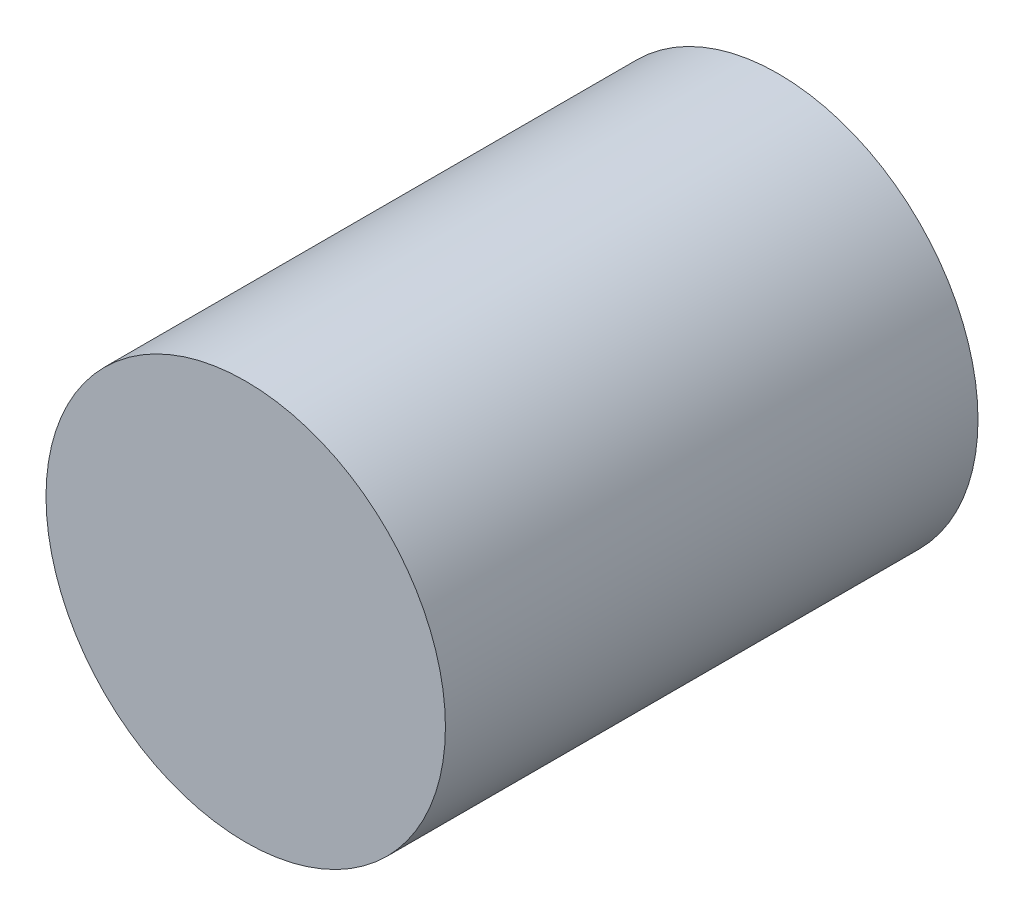
ISO-10303-21;
HEADER;
FILE_DESCRIPTION(('STEP AP214'),'2;1');
FILE_NAME('part.step','',(''),(''),'','','');
FILE_SCHEMA(('AUTOMOTIVE_DESIGN { 1 0 10303 214 1 1 1 1 }'));
ENDSEC;
DATA;
#1=APPLICATION_CONTEXT('core data for automotive mechanical design processes');
#2=APPLICATION_PROTOCOL_DEFINITION('international standard','automotive_design',2000,#1);
#3=PRODUCT_CONTEXT('',#1,'mechanical');
#4=PRODUCT('Part','Part','',(#3));
#5=PRODUCT_RELATED_PRODUCT_CATEGORY('part','',(#4));
#6=PRODUCT_DEFINITION_FORMATION('','',#4);
#7=PRODUCT_DEFINITION_CONTEXT('part definition',#1,'design');
#8=PRODUCT_DEFINITION('design','',#6,#7);
#9=PRODUCT_DEFINITION_SHAPE('','',#8);
#10=(LENGTH_UNIT() NAMED_UNIT(*) SI_UNIT(.MILLI.,.METRE.));
#11=(NAMED_UNIT(*) PLANE_ANGLE_UNIT() SI_UNIT($,.RADIAN.));
#12=(NAMED_UNIT(*) SI_UNIT($,.STERADIAN.) SOLID_ANGLE_UNIT());
#13=UNCERTAINTY_MEASURE_WITH_UNIT(LENGTH_MEASURE(1.E-05),#10,'distance_accuracy_value','');
#14=(GEOMETRIC_REPRESENTATION_CONTEXT(3) GLOBAL_UNCERTAINTY_ASSIGNED_CONTEXT((#13)) GLOBAL_UNIT_ASSIGNED_CONTEXT((#10,
#11,#12)) REPRESENTATION_CONTEXT('',''));
#15=CARTESIAN_POINT('',(0.,0.,0.));
#16=DIRECTION('',(0.,0.,1.));
#17=DIRECTION('',(1.,0.,0.));
#18=AXIS2_PLACEMENT_3D('',#15,#16,#17);
#19=CARTESIAN_POINT('',(0.,0.,5.08));
#20=DIRECTION('',(0.,0.,-1.));
#21=DIRECTION('',(-1.,0.,0.));
#22=AXIS2_PLACEMENT_3D('',#19,#20,#21);
#23=CYLINDRICAL_SURFACE('',#22,1.905);
#24=CARTESIAN_POINT('',(0.,0.,5.08));
#25=DIRECTION('',(0.,0.,1.));
#26=DIRECTION('',(1.,0.,0.));
#27=AXIS2_PLACEMENT_3D('',#24,#25,#26);
#28=CIRCLE('',#27,1.905);
#29=CARTESIAN_POINT('',(1.905,0.,5.08));
#30=VERTEX_POINT('',#29);
#31=EDGE_CURVE('E10',#30,#30,#28,.T.);
#32=ORIENTED_EDGE('',*,*,#31,.F.);
#33=EDGE_LOOP('',(#32));
#34=FACE_BOUND('',#33,.T.);
#35=CARTESIAN_POINT('',(0.,0.,0.));
#36=DIRECTION('',(0.,0.,1.));
#37=DIRECTION('',(1.,0.,0.));
#38=AXIS2_PLACEMENT_3D('',#35,#36,#37);
#39=CIRCLE('',#38,1.905);
#40=CARTESIAN_POINT('',(1.905,0.,0.));
#41=VERTEX_POINT('',#40);
#42=EDGE_CURVE('E34',#41,#41,#39,.T.);
#43=ORIENTED_EDGE('',*,*,#42,.T.);
#44=EDGE_LOOP('',(#43));
#45=FACE_BOUND('',#44,.T.);
#46=ADVANCED_FACE('F31',(#34,#45),#23,.T.);
#47=CARTESIAN_POINT('',(0.,0.,5.08));
#48=DIRECTION('',(0.,0.,1.));
#49=DIRECTION('',(1.,0.,0.));
#50=AXIS2_PLACEMENT_3D('',#47,#48,#49);
#51=PLANE('',#50);
#52=ORIENTED_EDGE('',*,*,#31,.T.);
#53=EDGE_LOOP('',(#52));
#54=FACE_BOUND('',#53,.T.);
#55=ADVANCED_FACE('F46',(#54),#51,.T.);
#56=CARTESIAN_POINT('',(0.,0.,0.));
#57=DIRECTION('',(0.,0.,1.));
#58=DIRECTION('',(1.,0.,0.));
#59=AXIS2_PLACEMENT_3D('',#56,#57,#58);
#60=PLANE('',#59);
#61=ORIENTED_EDGE('',*,*,#42,.F.);
#62=EDGE_LOOP('',(#61));
#63=FACE_BOUND('',#62,.T.);
#64=ADVANCED_FACE('F44',(#63),#60,.F.);
#65=CLOSED_SHELL('',(#46,#55,#64));
#66=MANIFOLD_SOLID_BREP('B2',#65);
#67=ADVANCED_BREP_SHAPE_REPRESENTATION('',(#18,#66),#14);
#68=SHAPE_DEFINITION_REPRESENTATION(#9,#67);
ENDSEC;
END-ISO-10303-21;
